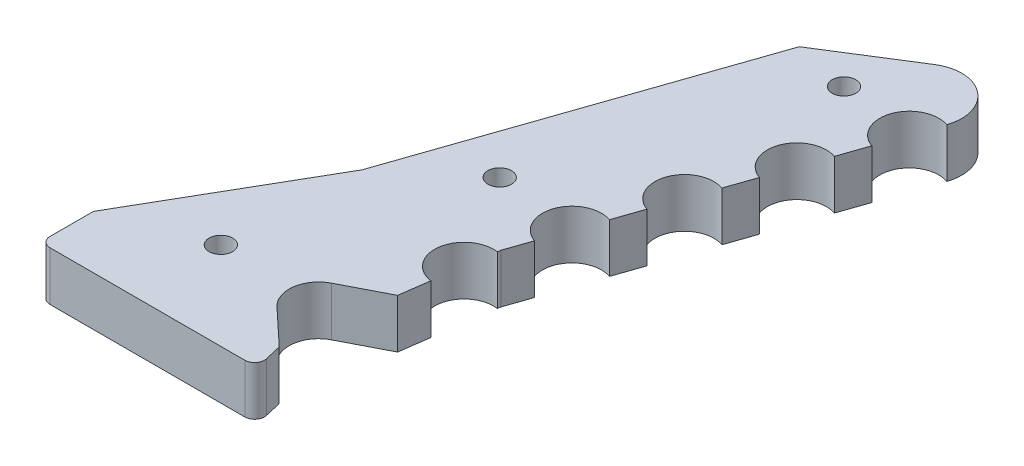
ISO-10303-21;
HEADER;
FILE_DESCRIPTION(('STEP AP214'),'2;1');
FILE_NAME('part.step','',(''),(''),'','','');
FILE_SCHEMA(('AUTOMOTIVE_DESIGN { 1 0 10303 214 1 1 1 1 }'));
ENDSEC;
DATA;
#1=APPLICATION_CONTEXT('core data for automotive mechanical design processes');
#2=APPLICATION_PROTOCOL_DEFINITION('international standard','automotive_design',2000,#1);
#3=PRODUCT_CONTEXT('',#1,'mechanical');
#4=PRODUCT('Part','Part','',(#3));
#5=PRODUCT_RELATED_PRODUCT_CATEGORY('part','',(#4));
#6=PRODUCT_DEFINITION_FORMATION('','',#4);
#7=PRODUCT_DEFINITION_CONTEXT('part definition',#1,'design');
#8=PRODUCT_DEFINITION('design','',#6,#7);
#9=PRODUCT_DEFINITION_SHAPE('','',#8);
#10=(LENGTH_UNIT() NAMED_UNIT(*) SI_UNIT(.MILLI.,.METRE.));
#11=(NAMED_UNIT(*) PLANE_ANGLE_UNIT() SI_UNIT($,.RADIAN.));
#12=(NAMED_UNIT(*) SI_UNIT($,.STERADIAN.) SOLID_ANGLE_UNIT());
#13=UNCERTAINTY_MEASURE_WITH_UNIT(LENGTH_MEASURE(1.E-05),#10,'distance_accuracy_value','');
#14=(GEOMETRIC_REPRESENTATION_CONTEXT(3) GLOBAL_UNCERTAINTY_ASSIGNED_CONTEXT((#13)) GLOBAL_UNIT_ASSIGNED_CONTEXT((#10,
#11,#12)) REPRESENTATION_CONTEXT('',''));
#15=CARTESIAN_POINT('',(0.,0.,0.));
#16=DIRECTION('',(0.,0.,1.));
#17=DIRECTION('',(1.,0.,0.));
#18=AXIS2_PLACEMENT_3D('',#15,#16,#17);
#19=CARTESIAN_POINT('',(24.1578897639016,5.,-47.3205080756888));
#20=DIRECTION('',(-0.990411286938688,0.,-0.138150217895061));
#21=DIRECTION('',(-0.138150217895061,0.,0.990411286938688));
#22=AXIS2_PLACEMENT_3D('',#19,#20,#21);
#23=PLANE('',#22);
#24=DIRECTION('',(0.138150217895061,0.,-0.990411286938688));
#25=VECTOR('',#24,1.);
#26=CARTESIAN_POINT('',(24.1578897639016,0.,-47.3205080756888));
#27=LINE('',#26,#25);
#28=CARTESIAN_POINT('',(22.8683748660811,0.,-38.0758602645134));
#29=VERTEX_POINT('',#28);
#30=CARTESIAN_POINT('',(23.2828255197663,0.,-41.0470941253295));
#31=VERTEX_POINT('',#30);
#32=EDGE_CURVE('E304',#29,#31,#27,.T.);
#33=ORIENTED_EDGE('',*,*,#32,.T.);
#34=DIRECTION('',(0.,1.,0.));
#35=VECTOR('',#34,1.);
#36=CARTESIAN_POINT('',(23.2828255197663,0.,-41.0470941253295));
#37=LINE('',#36,#35);
#38=CARTESIAN_POINT('',(23.2828255197663,5.,-41.0470941253295));
#39=VERTEX_POINT('',#38);
#40=EDGE_CURVE('E354',#31,#39,#37,.T.);
#41=ORIENTED_EDGE('',*,*,#40,.T.);
#42=DIRECTION('',(0.138150217895061,0.,-0.990411286938688));
#43=VECTOR('',#42,1.);
#44=CARTESIAN_POINT('',(24.1578897639016,5.,-47.3205080756888));
#45=LINE('',#44,#43);
#46=CARTESIAN_POINT('',(22.8683748660811,5.,-38.0758602645134));
#47=VERTEX_POINT('',#46);
#48=EDGE_CURVE('E283',#47,#39,#45,.T.);
#49=ORIENTED_EDGE('',*,*,#48,.F.);
#50=DIRECTION('',(0.,1.,0.));
#51=VECTOR('',#50,1.);
#52=CARTESIAN_POINT('',(22.8683748660811,0.,-38.0758602645134));
#53=LINE('',#52,#51);
#54=EDGE_CURVE('E364',#29,#47,#53,.T.);
#55=ORIENTED_EDGE('',*,*,#54,.F.);
#56=EDGE_LOOP('',(#33,#41,#49,#55));
#57=FACE_BOUND('',#56,.T.);
#58=ADVANCED_FACE('F36',(#57),#23,.F.);
#59=CARTESIAN_POINT('',(35.7715563017747,5.,-81.0490447646801));
#60=DIRECTION('',(-0.945518575599318,0.,-0.325568154457154));
#61=DIRECTION('',(-0.325568154457154,0.,0.945518575599318));
#62=AXIS2_PLACEMENT_3D('',#59,#60,#61);
#63=PLANE('',#62);
#64=DIRECTION('',(0.325568154457154,0.,-0.945518575599318));
#65=VECTOR('',#64,1.);
#66=CARTESIAN_POINT('',(35.7715563017747,0.,-81.0490447646801));
#67=LINE('',#66,#65);
#68=CARTESIAN_POINT('',(29.911329521546,0.,-64.0297104038924));
#69=VERTEX_POINT('',#68);
#70=CARTESIAN_POINT('',(30.8880339849174,0.,-66.8662661306903));
#71=VERTEX_POINT('',#70);
#72=EDGE_CURVE('E314',#69,#71,#67,.T.);
#73=ORIENTED_EDGE('',*,*,#72,.T.);
#74=DIRECTION('',(0.,1.,0.));
#75=VECTOR('',#74,1.);
#76=CARTESIAN_POINT('',(30.8880339849174,0.,-66.8662661306903));
#77=LINE('',#76,#75);
#78=CARTESIAN_POINT('',(30.8880339849174,5.,-66.8662661306903));
#79=VERTEX_POINT('',#78);
#80=EDGE_CURVE('E420',#71,#79,#77,.T.);
#81=ORIENTED_EDGE('',*,*,#80,.T.);
#82=DIRECTION('',(0.325568154457154,0.,-0.945518575599318));
#83=VECTOR('',#82,1.);
#84=CARTESIAN_POINT('',(35.7715563017747,5.,-81.0490447646801));
#85=LINE('',#84,#83);
#86=CARTESIAN_POINT('',(29.911329521546,5.,-64.0297104038924));
#87=VERTEX_POINT('',#86);
#88=EDGE_CURVE('E432',#87,#79,#85,.T.);
#89=ORIENTED_EDGE('',*,*,#88,.F.);
#90=DIRECTION('',(0.,1.,0.));
#91=VECTOR('',#90,1.);
#92=CARTESIAN_POINT('',(29.911329521546,0.,-64.0297104038924));
#93=LINE('',#92,#91);
#94=EDGE_CURVE('E339',#69,#87,#93,.T.);
#95=ORIENTED_EDGE('',*,*,#94,.F.);
#96=EDGE_LOOP('',(#73,#81,#89,#95));
#97=FACE_BOUND('',#96,.T.);
#98=ADVANCED_FACE('F460',(#97),#63,.F.);
#99=CARTESIAN_POINT('',(26.9812161314316,0.,-55.5200432234985));
#100=VERTEX_POINT('',#99);
#101=CARTESIAN_POINT('',(27.957920594803,0.,-58.3565989502965));
#102=VERTEX_POINT('',#101);
#103=EDGE_CURVE('E227',#100,#102,#67,.T.);
#104=ORIENTED_EDGE('',*,*,#103,.T.);
#105=DIRECTION('',(0.,1.,0.));
#106=VECTOR('',#105,1.);
#107=CARTESIAN_POINT('',(27.957920594803,0.,-58.3565989502965));
#108=LINE('',#107,#106);
#109=CARTESIAN_POINT('',(27.957920594803,5.,-58.3565989502965));
#110=VERTEX_POINT('',#109);
#111=EDGE_CURVE('E329',#102,#110,#108,.T.);
#112=ORIENTED_EDGE('',*,*,#111,.T.);
#113=CARTESIAN_POINT('',(26.9812161314316,5.,-55.5200432234985));
#114=VERTEX_POINT('',#113);
#115=EDGE_CURVE('E293',#114,#110,#85,.T.);
#116=ORIENTED_EDGE('',*,*,#115,.F.);
#117=DIRECTION('',(0.,1.,0.));
#118=VECTOR('',#117,1.);
#119=CARTESIAN_POINT('',(26.9812161314316,0.,-55.5200432234985));
#120=LINE('',#119,#118);
#121=EDGE_CURVE('E331',#100,#114,#120,.T.);
#122=ORIENTED_EDGE('',*,*,#121,.F.);
#123=EDGE_LOOP('',(#104,#112,#116,#122));
#124=FACE_BOUND('',#123,.T.);
#125=ADVANCED_FACE('F327',(#124),#63,.F.);
#126=CARTESIAN_POINT('',(24.1578897639016,0.,-47.3205080756888));
#127=VERTEX_POINT('',#126);
#128=CARTESIAN_POINT('',(25.0278072046886,0.,-49.8469317699026));
#129=VERTEX_POINT('',#128);
#130=EDGE_CURVE('E221',#127,#129,#67,.T.);
#131=ORIENTED_EDGE('',*,*,#130,.T.);
#132=DIRECTION('',(0.,1.,0.));
#133=VECTOR('',#132,1.);
#134=CARTESIAN_POINT('',(25.0278072046887,0.,-49.8469317699026));
#135=LINE('',#134,#133);
#136=CARTESIAN_POINT('',(25.0278072046887,5.,-49.8469317699026));
#137=VERTEX_POINT('',#136);
#138=EDGE_CURVE('E343',#129,#137,#135,.T.);
#139=ORIENTED_EDGE('',*,*,#138,.T.);
#140=CARTESIAN_POINT('',(24.1578897639016,5.,-47.3205080756888));
#141=VERTEX_POINT('',#140);
#142=EDGE_CURVE('E290',#141,#137,#85,.T.);
#143=ORIENTED_EDGE('',*,*,#142,.F.);
#144=DIRECTION('',(0.,-1.,0.));
#145=VECTOR('',#144,1.);
#146=CARTESIAN_POINT('',(24.1578897639016,5.,-47.3205080756888));
#147=LINE('',#146,#145);
#148=EDGE_CURVE('E212',#141,#127,#147,.T.);
#149=ORIENTED_EDGE('',*,*,#148,.T.);
#150=EDGE_LOOP('',(#131,#139,#143,#149));
#151=FACE_BOUND('',#150,.T.);
#152=ADVANCED_FACE('F443',(#151),#63,.F.);
#153=CARTESIAN_POINT('',(21.3948854060003,5.,-80.4136582216649));
#154=DIRECTION('',(0.532370499844366,0.,0.846511459399966));
#155=DIRECTION('',(0.846511459399966,0.,-0.532370499844366));
#156=AXIS2_PLACEMENT_3D('',#153,#154,#155);
#157=PLANE('',#156);
#158=DIRECTION('',(-0.846511459399966,0.,0.532370499844366));
#159=VECTOR('',#158,1.);
#160=CARTESIAN_POINT('',(21.3948854060003,0.,-80.4136582216649));
#161=LINE('',#160,#159);
#162=CARTESIAN_POINT('',(29.86,0.,-85.7373632201086));
#163=VERTEX_POINT('',#162);
#164=CARTESIAN_POINT('',(21.3948854060003,0.,-80.4136582216649));
#165=VERTEX_POINT('',#164);
#166=EDGE_CURVE('E219',#163,#165,#161,.T.);
#167=ORIENTED_EDGE('',*,*,#166,.T.);
#168=DIRECTION('',(0.,-1.,0.));
#169=VECTOR('',#168,1.);
#170=CARTESIAN_POINT('',(21.3948854060003,5.,-80.4136582216649));
#171=LINE('',#170,#169);
#172=CARTESIAN_POINT('',(21.3948854060003,5.,-80.4136582216649));
#173=VERTEX_POINT('',#172);
#174=EDGE_CURVE('E244',#173,#165,#171,.T.);
#175=ORIENTED_EDGE('',*,*,#174,.F.);
#176=DIRECTION('',(-0.846511459399966,0.,0.532370499844366));
#177=VECTOR('',#176,1.);
#178=CARTESIAN_POINT('',(21.3948854060003,5.,-80.4136582216649));
#179=LINE('',#178,#177);
#180=CARTESIAN_POINT('',(29.86,5.,-85.7373632201086));
#181=VERTEX_POINT('',#180);
#182=EDGE_CURVE('E220',#181,#173,#179,.T.);
#183=ORIENTED_EDGE('',*,*,#182,.F.);
#184=DIRECTION('',(0.,-1.,0.));
#185=VECTOR('',#184,1.);
#186=CARTESIAN_POINT('',(29.86,5.,-85.7373632201086));
#187=LINE('',#186,#185);
#188=EDGE_CURVE('E213',#181,#163,#187,.T.);
#189=ORIENTED_EDGE('',*,*,#188,.T.);
#190=EDGE_LOOP('',(#167,#175,#183,#189));
#191=FACE_BOUND('',#190,.T.);
#192=ADVANCED_FACE('F482',(#191),#157,.F.);
#193=CARTESIAN_POINT('',(9.99999999999996,5.,-47.3205080756888));
#194=DIRECTION('',(0.945518575599318,0.,0.325568154457154));
#195=DIRECTION('',(0.325568154457154,0.,-0.945518575599318));
#196=AXIS2_PLACEMENT_3D('',#193,#194,#195);
#197=PLANE('',#196);
#198=DIRECTION('',(-0.325568154457154,0.,0.945518575599318));
#199=VECTOR('',#198,1.);
#200=CARTESIAN_POINT('',(9.99999999999996,0.,-47.3205080756888));
#201=LINE('',#200,#199);
#202=CARTESIAN_POINT('',(9.99999999999996,0.,-47.3205080756888));
#203=VERTEX_POINT('',#202);
#204=EDGE_CURVE('E297',#165,#203,#201,.T.);
#205=ORIENTED_EDGE('',*,*,#204,.T.);
#206=DIRECTION('',(0.,-1.,0.));
#207=VECTOR('',#206,1.);
#208=CARTESIAN_POINT('',(9.99999999999996,5.,-47.3205080756888));
#209=LINE('',#208,#207);
#210=CARTESIAN_POINT('',(9.99999999999996,5.,-47.3205080756888));
#211=VERTEX_POINT('',#210);
#212=EDGE_CURVE('E241',#211,#203,#209,.T.);
#213=ORIENTED_EDGE('',*,*,#212,.F.);
#214=DIRECTION('',(-0.325568154457154,0.,0.945518575599318));
#215=VECTOR('',#214,1.);
#216=CARTESIAN_POINT('',(9.99999999999996,5.,-47.3205080756888));
#217=LINE('',#216,#215);
#218=EDGE_CURVE('E224',#173,#211,#217,.T.);
#219=ORIENTED_EDGE('',*,*,#218,.F.);
#220=ORIENTED_EDGE('',*,*,#174,.T.);
#221=EDGE_LOOP('',(#205,#213,#219,#220));
#222=FACE_BOUND('',#221,.T.);
#223=ADVANCED_FACE('F479',(#222),#197,.F.);
#224=CARTESIAN_POINT('',(0.,5.,-30.));
#225=DIRECTION('',(0.86602540378444,0.,0.499999999999998));
#226=DIRECTION('',(0.499999999999998,0.,-0.86602540378444));
#227=AXIS2_PLACEMENT_3D('',#224,#225,#226);
#228=PLANE('',#227);
#229=DIRECTION('',(-0.499999999999998,0.,0.86602540378444));
#230=VECTOR('',#229,1.);
#231=CARTESIAN_POINT('',(0.,0.,-30.));
#232=LINE('',#231,#230);
#233=CARTESIAN_POINT('',(0.,0.,-30.));
#234=VERTEX_POINT('',#233);
#235=EDGE_CURVE('E299',#203,#234,#232,.T.);
#236=ORIENTED_EDGE('',*,*,#235,.T.);
#237=DIRECTION('',(0.,-1.,0.));
#238=VECTOR('',#237,1.);
#239=CARTESIAN_POINT('',(0.,5.,-30.));
#240=LINE('',#239,#238);
#241=CARTESIAN_POINT('',(0.,5.,-30.));
#242=VERTEX_POINT('',#241);
#243=EDGE_CURVE('E238',#242,#234,#240,.T.);
#244=ORIENTED_EDGE('',*,*,#243,.F.);
#245=DIRECTION('',(-0.499999999999998,0.,0.86602540378444));
#246=VECTOR('',#245,1.);
#247=CARTESIAN_POINT('',(0.,5.,-30.));
#248=LINE('',#247,#246);
#249=EDGE_CURVE('E286',#211,#242,#248,.T.);
#250=ORIENTED_EDGE('',*,*,#249,.F.);
#251=ORIENTED_EDGE('',*,*,#212,.T.);
#252=EDGE_LOOP('',(#236,#244,#250,#251));
#253=FACE_BOUND('',#252,.T.);
#254=ADVANCED_FACE('F395',(#253),#228,.F.);
#255=CARTESIAN_POINT('',(0.,5.,0.));
#256=DIRECTION('',(1.,0.,0.));
#257=DIRECTION('',(0.,0.,-1.));
#258=AXIS2_PLACEMENT_3D('',#255,#256,#257);
#259=PLANE('',#258);
#260=DIRECTION('',(0.,0.,1.));
#261=VECTOR('',#260,1.);
#262=CARTESIAN_POINT('',(0.,0.,0.));
#263=LINE('',#262,#261);
#264=CARTESIAN_POINT('',(0.,0.,-25.5883219764711));
#265=VERTEX_POINT('',#264);
#266=EDGE_CURVE('E301',#234,#265,#263,.T.);
#267=ORIENTED_EDGE('',*,*,#266,.T.);
#268=DIRECTION('',(0.,1.,0.));
#269=VECTOR('',#268,1.);
#270=CARTESIAN_POINT('',(0.,5.,-25.5883219764711));
#271=LINE('',#270,#269);
#272=CARTESIAN_POINT('',(0.,5.,-25.5883219764711));
#273=VERTEX_POINT('',#272);
#274=EDGE_CURVE('E11',#265,#273,#271,.T.);
#275=ORIENTED_EDGE('',*,*,#274,.T.);
#276=DIRECTION('',(0.,0.,1.));
#277=VECTOR('',#276,1.);
#278=CARTESIAN_POINT('',(0.,5.,0.));
#279=LINE('',#278,#277);
#280=EDGE_CURVE('E281',#242,#273,#279,.T.);
#281=ORIENTED_EDGE('',*,*,#280,.F.);
#282=ORIENTED_EDGE('',*,*,#243,.T.);
#283=EDGE_LOOP('',(#267,#275,#281,#282));
#284=FACE_BOUND('',#283,.T.);
#285=ADVANCED_FACE('F398',(#284),#259,.F.);
#286=CARTESIAN_POINT('',(21.3948854060003,5.,-27.512282336915));
#287=DIRECTION('',(-0.974653453481312,0.,0.223720016129428));
#288=DIRECTION('',(0.223720016129428,0.,0.974653453481312));
#289=AXIS2_PLACEMENT_3D('',#286,#287,#288);
#290=PLANE('',#289);
#291=DIRECTION('',(-0.223720016129428,0.,-0.974653453481312));
#292=VECTOR('',#291,1.);
#293=CARTESIAN_POINT('',(21.3948854060003,5.,-27.512282336915));
#294=LINE('',#293,#292);
#295=CARTESIAN_POINT('',(21.785155194606,5.,-25.8120419926005));
#296=VERTEX_POINT('',#295);
#297=CARTESIAN_POINT('',(21.3948854060003,5.,-27.512282336915));
#298=VERTEX_POINT('',#297);
#299=EDGE_CURVE('E276',#296,#298,#294,.T.);
#300=ORIENTED_EDGE('',*,*,#299,.F.);
#301=DIRECTION('',(0.,1.,0.));
#302=VECTOR('',#301,1.);
#303=CARTESIAN_POINT('',(21.785155194606,5.,-25.8120419926005));
#304=LINE('',#303,#302);
#305=CARTESIAN_POINT('',(21.785155194606,0.,-25.8120419926005));
#306=VERTEX_POINT('',#305);
#307=EDGE_CURVE('E59',#296,#306,#304,.F.);
#308=ORIENTED_EDGE('',*,*,#307,.T.);
#309=DIRECTION('',(-0.223720016129428,0.,-0.974653453481312));
#310=VECTOR('',#309,1.);
#311=CARTESIAN_POINT('',(21.3948854060003,0.,-27.512282336915));
#312=LINE('',#311,#310);
#313=CARTESIAN_POINT('',(21.3948854060003,0.,-27.512282336915));
#314=VERTEX_POINT('',#313);
#315=EDGE_CURVE('E261',#306,#314,#312,.T.);
#316=ORIENTED_EDGE('',*,*,#315,.T.);
#317=DIRECTION('',(0.,-1.,0.));
#318=VECTOR('',#317,1.);
#319=CARTESIAN_POINT('',(21.3948854060003,5.,-27.512282336915));
#320=LINE('',#319,#318);
#321=EDGE_CURVE('E235',#298,#314,#320,.T.);
#322=ORIENTED_EDGE('',*,*,#321,.F.);
#323=EDGE_LOOP('',(#300,#308,#316,#322));
#324=FACE_BOUND('',#323,.T.);
#325=ADVANCED_FACE('F279',(#324),#290,.F.);
#326=CARTESIAN_POINT('',(24.1117268271366,5.,-46.9895618469616));
#327=VERTEX_POINT('',#326);
#328=EDGE_CURVE('E280',#327,#141,#45,.T.);
#329=ORIENTED_EDGE('',*,*,#328,.F.);
#330=DIRECTION('',(0.,1.,0.));
#331=VECTOR('',#330,1.);
#332=CARTESIAN_POINT('',(24.1117268271366,0.,-46.9895618469616));
#333=LINE('',#332,#331);
#334=CARTESIAN_POINT('',(24.1117268271366,0.,-46.9895618469616));
#335=VERTEX_POINT('',#334);
#336=EDGE_CURVE('E361',#335,#327,#333,.T.);
#337=ORIENTED_EDGE('',*,*,#336,.F.);
#338=EDGE_CURVE('E303',#335,#127,#27,.T.);
#339=ORIENTED_EDGE('',*,*,#338,.T.);
#340=ORIENTED_EDGE('',*,*,#148,.F.);
#341=EDGE_LOOP('',(#329,#337,#339,#340));
#342=FACE_BOUND('',#341,.T.);
#343=ADVANCED_FACE('F445',(#342),#23,.F.);
#344=CARTESIAN_POINT('',(32.8414429116603,0.,-72.5393775842862));
#345=VERTEX_POINT('',#344);
#346=CARTESIAN_POINT('',(33.8181473750318,0.,-75.3759333110842));
#347=VERTEX_POINT('',#346);
#348=EDGE_CURVE('E229',#345,#347,#67,.T.);
#349=ORIENTED_EDGE('',*,*,#348,.T.);
#350=DIRECTION('',(0.,1.,0.));
#351=VECTOR('',#350,1.);
#352=CARTESIAN_POINT('',(33.8181473750318,0.,-75.3759333110842));
#353=LINE('',#352,#351);
#354=CARTESIAN_POINT('',(33.8181473750318,5.,-75.3759333110842));
#355=VERTEX_POINT('',#354);
#356=EDGE_CURVE('E199',#347,#355,#353,.T.);
#357=ORIENTED_EDGE('',*,*,#356,.T.);
#358=CARTESIAN_POINT('',(32.8414429116603,5.,-72.5393775842862));
#359=VERTEX_POINT('',#358);
#360=EDGE_CURVE('E294',#359,#355,#85,.T.);
#361=ORIENTED_EDGE('',*,*,#360,.F.);
#362=DIRECTION('',(0.,1.,0.));
#363=VECTOR('',#362,1.);
#364=CARTESIAN_POINT('',(32.8414429116603,0.,-72.5393775842862));
#365=LINE('',#364,#363);
#366=EDGE_CURVE('E346',#345,#359,#365,.T.);
#367=ORIENTED_EDGE('',*,*,#366,.F.);
#368=EDGE_LOOP('',(#349,#357,#361,#367));
#369=FACE_BOUND('',#368,.T.);
#370=ADVANCED_FACE('F433',(#369),#63,.F.);
#371=CARTESIAN_POINT('',(31.9894819993774,5.,-82.3513173825088));
#372=DIRECTION('',(0.,-1.,0.));
#373=DIRECTION('',(0.,0.,-1.));
#374=AXIS2_PLACEMENT_3D('',#371,#372,#373);
#375=CYLINDRICAL_SURFACE('',#374,3.99999999999999);
#376=CARTESIAN_POINT('',(31.9894819993774,0.,-82.3513173825088));
#377=DIRECTION('',(0.,1.,0.));
#378=DIRECTION('',(0.,0.,-1.));
#379=AXIS2_PLACEMENT_3D('',#376,#377,#378);
#380=CIRCLE('',#379,3.99999999999999);
#381=CARTESIAN_POINT('',(35.7715563017747,0.,-81.0490447646801));
#382=VERTEX_POINT('',#381);
#383=EDGE_CURVE('E209',#382,#163,#380,.T.);
#384=ORIENTED_EDGE('',*,*,#383,.T.);
#385=ORIENTED_EDGE('',*,*,#188,.F.);
#386=CARTESIAN_POINT('',(31.9894819993774,5.,-82.3513173825088));
#387=DIRECTION('',(0.,1.,0.));
#388=DIRECTION('',(0.,0.,-1.));
#389=AXIS2_PLACEMENT_3D('',#386,#387,#388);
#390=CIRCLE('',#389,3.99999999999999);
#391=CARTESIAN_POINT('',(35.7715563017747,5.,-81.0490447646801));
#392=VERTEX_POINT('',#391);
#393=EDGE_CURVE('E211',#392,#181,#390,.T.);
#394=ORIENTED_EDGE('',*,*,#393,.F.);
#395=DIRECTION('',(0.,-1.,0.));
#396=VECTOR('',#395,1.);
#397=CARTESIAN_POINT('',(35.7715563017747,5.,-81.0490447646801));
#398=LINE('',#397,#396);
#399=EDGE_CURVE('E196',#392,#382,#398,.T.);
#400=ORIENTED_EDGE('',*,*,#399,.T.);
#401=EDGE_LOOP('',(#384,#385,#394,#400));
#402=FACE_BOUND('',#401,.T.);
#403=ADVANCED_FACE('F207',(#402),#375,.T.);
#404=CARTESIAN_POINT('',(31.9894819993774,5.,-82.3513173825088));
#405=DIRECTION('',(0.,-1.,0.));
#406=DIRECTION('',(0.,0.,-1.));
#407=AXIS2_PLACEMENT_3D('',#404,#405,#406);
#408=PLANE('',#407);
#409=CARTESIAN_POINT('',(9.43278631160015,5.,-33.5342728019948));
#410=DIRECTION('',(0.,1.,0.));
#411=DIRECTION('',(0.,0.,1.));
#412=AXIS2_PLACEMENT_3D('',#409,#410,#411);
#413=CIRCLE('',#412,1.2);
#414=CARTESIAN_POINT('',(9.43278631160015,5.,-32.3342728019948));
#415=VERTEX_POINT('',#414);
#416=EDGE_CURVE('E382',#415,#415,#413,.T.);
#417=ORIENTED_EDGE('',*,*,#416,.F.);
#418=EDGE_LOOP('',(#417));
#419=FACE_BOUND('',#418,.T.);
#420=CARTESIAN_POINT('',(17.6754420810914,5.,-53.660191960072));
#421=DIRECTION('',(0.,1.,0.));
#422=DIRECTION('',(0.,0.,1.));
#423=AXIS2_PLACEMENT_3D('',#420,#421,#422);
#424=CIRCLE('',#423,1.2);
#425=CARTESIAN_POINT('',(17.6754420810914,5.,-52.460191960072));
#426=VERTEX_POINT('',#425);
#427=EDGE_CURVE('E408',#426,#426,#424,.T.);
#428=ORIENTED_EDGE('',*,*,#427,.F.);
#429=EDGE_LOOP('',(#428));
#430=FACE_BOUND('',#429,.T.);
#431=CARTESIAN_POINT('',(27.1732683912637,5.,-79.1891935012536));
#432=DIRECTION('',(0.,1.,0.));
#433=DIRECTION('',(0.,0.,1.));
#434=AXIS2_PLACEMENT_3D('',#431,#432,#433);
#435=CIRCLE('',#434,1.2);
#436=CARTESIAN_POINT('',(27.1732683912637,5.,-77.9891935012536));
#437=VERTEX_POINT('',#436);
#438=EDGE_CURVE('E414',#437,#437,#435,.T.);
#439=ORIENTED_EDGE('',*,*,#438,.F.);
#440=EDGE_LOOP('',(#439));
#441=FACE_BOUND('',#440,.T.);
#442=DIRECTION('',(-1.,0.,0.));
#443=VECTOR('',#442,1.);
#444=CARTESIAN_POINT('',(22.0660454543886,5.,-24.5883219764711));
#445=LINE('',#444,#443);
#446=CARTESIAN_POINT('',(20.8105017411247,5.,-24.5883219764711));
#447=VERTEX_POINT('',#446);
#448=CARTESIAN_POINT('',(1.,5.,-24.5883219764711));
#449=VERTEX_POINT('',#448);
#450=EDGE_CURVE('E270',#447,#449,#445,.T.);
#451=ORIENTED_EDGE('',*,*,#450,.F.);
#452=CARTESIAN_POINT('',(20.8105017411247,5.,-25.5883219764711));
#453=DIRECTION('',(0.,-1.,0.));
#454=DIRECTION('',(0.,0.,-1.));
#455=AXIS2_PLACEMENT_3D('',#452,#453,#454);
#456=CIRCLE('',#455,1.);
#457=EDGE_CURVE('E254',#447,#296,#456,.F.);
#458=ORIENTED_EDGE('',*,*,#457,.T.);
#459=ORIENTED_EDGE('',*,*,#299,.T.);
#460=DIRECTION('',(-0.72987002388853,0.,-0.6835859479458));
#461=VECTOR('',#460,1.);
#462=CARTESIAN_POINT('',(23.7242831618267,5.,-25.3306013239371));
#463=LINE('',#462,#461);
#464=CARTESIAN_POINT('',(17.7455352865577,5.,-30.930212076644));
#465=VERTEX_POINT('',#464);
#466=EDGE_CURVE('E371',#298,#465,#463,.T.);
#467=ORIENTED_EDGE('',*,*,#466,.T.);
#468=CARTESIAN_POINT('',(19.7962931303951,5.,-33.1198221483096));
#469=DIRECTION('',(0.,1.,0.));
#470=DIRECTION('',(0.,0.,1.));
#471=AXIS2_PLACEMENT_3D('',#468,#469,#470);
#472=CIRCLE('',#471,3.);
#473=CARTESIAN_POINT('',(18.4230038326927,5.,-35.7870447683427));
#474=VERTEX_POINT('',#473);
#475=EDGE_CURVE('E381',#474,#465,#472,.T.);
#476=ORIENTED_EDGE('',*,*,#475,.F.);
#477=DIRECTION('',(-0.889074206677684,0.,0.457763099234143));
#478=VECTOR('',#477,1.);
#479=CARTESIAN_POINT('',(-10.7043172544185,5.,-20.7900820029413));
#480=LINE('',#479,#478);
#481=EDGE_CURVE('E378',#47,#474,#480,.T.);
#482=ORIENTED_EDGE('',*,*,#481,.F.);
#483=ORIENTED_EDGE('',*,*,#48,.T.);
#484=CARTESIAN_POINT('',(23.6972761734514,5.,-44.0183279861455));
#485=DIRECTION('',(0.,1.,0.));
#486=DIRECTION('',(0.,0.,1.));
#487=AXIS2_PLACEMENT_3D('',#484,#485,#486);
#488=CIRCLE('',#487,3.);
#489=EDGE_CURVE('E362',#327,#39,#488,.T.);
#490=ORIENTED_EDGE('',*,*,#489,.F.);
#491=ORIENTED_EDGE('',*,*,#328,.T.);
#492=ORIENTED_EDGE('',*,*,#142,.T.);
#493=CARTESIAN_POINT('',(26.0045116680601,5.,-52.6834874967006));
#494=DIRECTION('',(0.,1.,0.));
#495=DIRECTION('',(0.,0.,1.));
#496=AXIS2_PLACEMENT_3D('',#493,#494,#495);
#497=CIRCLE('',#496,3.);
#498=EDGE_CURVE('E352',#114,#137,#497,.T.);
#499=ORIENTED_EDGE('',*,*,#498,.F.);
#500=ORIENTED_EDGE('',*,*,#115,.T.);
#501=CARTESIAN_POINT('',(28.9346250581745,5.,-61.1931546770944));
#502=DIRECTION('',(0.,1.,0.));
#503=DIRECTION('',(0.,0.,1.));
#504=AXIS2_PLACEMENT_3D('',#501,#502,#503);
#505=CIRCLE('',#504,3.);
#506=EDGE_CURVE('E340',#87,#110,#505,.T.);
#507=ORIENTED_EDGE('',*,*,#506,.F.);
#508=ORIENTED_EDGE('',*,*,#88,.T.);
#509=CARTESIAN_POINT('',(31.8647384482889,5.,-69.7028218574883));
#510=DIRECTION('',(0.,1.,0.));
#511=DIRECTION('',(0.,0.,1.));
#512=AXIS2_PLACEMENT_3D('',#509,#510,#511);
#513=CIRCLE('',#512,3.00000000000001);
#514=EDGE_CURVE('E349',#359,#79,#513,.T.);
#515=ORIENTED_EDGE('',*,*,#514,.F.);
#516=ORIENTED_EDGE('',*,*,#360,.T.);
#517=CARTESIAN_POINT('',(34.7948518384033,5.,-78.2124890378822));
#518=DIRECTION('',(0.,1.,0.));
#519=DIRECTION('',(0.,0.,1.));
#520=AXIS2_PLACEMENT_3D('',#517,#518,#519);
#521=CIRCLE('',#520,3.00000000000001);
#522=EDGE_CURVE('E203',#392,#355,#521,.T.);
#523=ORIENTED_EDGE('',*,*,#522,.F.);
#524=ORIENTED_EDGE('',*,*,#393,.T.);
#525=ORIENTED_EDGE('',*,*,#182,.T.);
#526=ORIENTED_EDGE('',*,*,#218,.T.);
#527=ORIENTED_EDGE('',*,*,#249,.T.);
#528=ORIENTED_EDGE('',*,*,#280,.T.);
#529=CARTESIAN_POINT('',(1.,5.,-25.5883219764711));
#530=DIRECTION('',(0.,-1.,0.));
#531=DIRECTION('',(0.,0.,-1.));
#532=AXIS2_PLACEMENT_3D('',#529,#530,#531);
#533=CIRCLE('',#532,1.);
#534=EDGE_CURVE('E252',#273,#449,#533,.F.);
#535=ORIENTED_EDGE('',*,*,#534,.T.);
#536=EDGE_LOOP('',(#451,#458,#459,#467,#476,#482,#483,#490,#491,#492,#499,#500,#507,#508,#515,
#516,#523,#524,#525,#526,#527,#528,#535));
#537=FACE_BOUND('',#536,.T.);
#538=ADVANCED_FACE('F274',(#419,#430,#441,#537),#408,.F.);
#539=CARTESIAN_POINT('',(31.9894819993774,0.,-82.3513173825088));
#540=DIRECTION('',(0.,-1.,0.));
#541=DIRECTION('',(0.,0.,-1.));
#542=AXIS2_PLACEMENT_3D('',#539,#540,#541);
#543=PLANE('',#542);
#544=ORIENTED_EDGE('',*,*,#315,.F.);
#545=CARTESIAN_POINT('',(20.8105017411247,0.,-25.5883219764711));
#546=DIRECTION('',(0.,-1.,0.));
#547=DIRECTION('',(0.,0.,-1.));
#548=AXIS2_PLACEMENT_3D('',#545,#546,#547);
#549=CIRCLE('',#548,1.);
#550=CARTESIAN_POINT('',(20.8105017411247,0.,-24.5883219764711));
#551=VERTEX_POINT('',#550);
#552=EDGE_CURVE('E44',#306,#551,#549,.T.);
#553=ORIENTED_EDGE('',*,*,#552,.T.);
#554=DIRECTION('',(-1.,0.,0.));
#555=VECTOR('',#554,1.);
#556=CARTESIAN_POINT('',(28.6147132621544,0.,-24.5883219764711));
#557=LINE('',#556,#555);
#558=CARTESIAN_POINT('',(1.,0.,-24.5883219764711));
#559=VERTEX_POINT('',#558);
#560=EDGE_CURVE('E259',#551,#559,#557,.T.);
#561=ORIENTED_EDGE('',*,*,#560,.T.);
#562=CARTESIAN_POINT('',(1.,0.,-25.5883219764711));
#563=DIRECTION('',(0.,-1.,0.));
#564=DIRECTION('',(0.,0.,-1.));
#565=AXIS2_PLACEMENT_3D('',#562,#563,#564);
#566=CIRCLE('',#565,1.);
#567=EDGE_CURVE('E51',#559,#265,#566,.T.);
#568=ORIENTED_EDGE('',*,*,#567,.T.);
#569=ORIENTED_EDGE('',*,*,#266,.F.);
#570=ORIENTED_EDGE('',*,*,#235,.F.);
#571=ORIENTED_EDGE('',*,*,#204,.F.);
#572=ORIENTED_EDGE('',*,*,#166,.F.);
#573=ORIENTED_EDGE('',*,*,#383,.F.);
#574=CARTESIAN_POINT('',(34.7948518384033,0.,-78.2124890378822));
#575=DIRECTION('',(0.,1.,0.));
#576=DIRECTION('',(0.,0.,1.));
#577=AXIS2_PLACEMENT_3D('',#574,#575,#576);
#578=CIRCLE('',#577,3.00000000000001);
#579=EDGE_CURVE('E193',#382,#347,#578,.T.);
#580=ORIENTED_EDGE('',*,*,#579,.T.);
#581=ORIENTED_EDGE('',*,*,#348,.F.);
#582=CARTESIAN_POINT('',(31.8647384482889,0.,-69.7028218574883));
#583=DIRECTION('',(0.,1.,0.));
#584=DIRECTION('',(0.,0.,1.));
#585=AXIS2_PLACEMENT_3D('',#582,#583,#584);
#586=CIRCLE('',#585,3.00000000000001);
#587=EDGE_CURVE('E422',#345,#71,#586,.T.);
#588=ORIENTED_EDGE('',*,*,#587,.T.);
#589=ORIENTED_EDGE('',*,*,#72,.F.);
#590=CARTESIAN_POINT('',(28.9346250581745,0.,-61.1931546770944));
#591=DIRECTION('',(0.,1.,0.));
#592=DIRECTION('',(0.,0.,1.));
#593=AXIS2_PLACEMENT_3D('',#590,#591,#592);
#594=CIRCLE('',#593,3.);
#595=EDGE_CURVE('E336',#69,#102,#594,.T.);
#596=ORIENTED_EDGE('',*,*,#595,.T.);
#597=ORIENTED_EDGE('',*,*,#103,.F.);
#598=CARTESIAN_POINT('',(26.0045116680601,0.,-52.6834874967006));
#599=DIRECTION('',(0.,1.,0.));
#600=DIRECTION('',(0.,0.,1.));
#601=AXIS2_PLACEMENT_3D('',#598,#599,#600);
#602=CIRCLE('',#601,3.);
#603=EDGE_CURVE('E335',#100,#129,#602,.T.);
#604=ORIENTED_EDGE('',*,*,#603,.T.);
#605=ORIENTED_EDGE('',*,*,#130,.F.);
#606=ORIENTED_EDGE('',*,*,#338,.F.);
#607=CARTESIAN_POINT('',(23.6972761734514,0.,-44.0183279861455));
#608=DIRECTION('',(0.,1.,0.));
#609=DIRECTION('',(0.,0.,1.));
#610=AXIS2_PLACEMENT_3D('',#607,#608,#609);
#611=CIRCLE('',#610,3.);
#612=EDGE_CURVE('E358',#335,#31,#611,.T.);
#613=ORIENTED_EDGE('',*,*,#612,.T.);
#614=ORIENTED_EDGE('',*,*,#32,.F.);
#615=DIRECTION('',(-0.889074206677684,0.,0.457763099234143));
#616=VECTOR('',#615,1.);
#617=CARTESIAN_POINT('',(-10.7043172544185,0.,-20.7900820029413));
#618=LINE('',#617,#616);
#619=CARTESIAN_POINT('',(18.4230038326927,0.,-35.7870447683427));
#620=VERTEX_POINT('',#619);
#621=EDGE_CURVE('E367',#29,#620,#618,.T.);
#622=ORIENTED_EDGE('',*,*,#621,.T.);
#623=CARTESIAN_POINT('',(19.7962931303951,0.,-33.1198221483096));
#624=DIRECTION('',(0.,1.,0.));
#625=DIRECTION('',(0.,0.,1.));
#626=AXIS2_PLACEMENT_3D('',#623,#624,#625);
#627=CIRCLE('',#626,3.);
#628=CARTESIAN_POINT('',(17.7455352865577,0.,-30.9302120766441));
#629=VERTEX_POINT('',#628);
#630=EDGE_CURVE('E370',#620,#629,#627,.T.);
#631=ORIENTED_EDGE('',*,*,#630,.T.);
#632=DIRECTION('',(-0.72987002388853,0.,-0.6835859479458));
#633=VECTOR('',#632,1.);
#634=CARTESIAN_POINT('',(23.7242831618267,0.,-25.3306013239371));
#635=LINE('',#634,#633);
#636=EDGE_CURVE('E374',#314,#629,#635,.T.);
#637=ORIENTED_EDGE('',*,*,#636,.F.);
#638=EDGE_LOOP('',(#544,#553,#561,#568,#569,#570,#571,#572,#573,#580,#581,#588,#589,#596,#597,
#604,#605,#606,#613,#614,#622,#631,#637));
#639=FACE_BOUND('',#638,.T.);
#640=CARTESIAN_POINT('',(9.43278631160015,0.,-33.5342728019948));
#641=DIRECTION('',(0.,1.,0.));
#642=DIRECTION('',(0.,0.,1.));
#643=AXIS2_PLACEMENT_3D('',#640,#641,#642);
#644=CIRCLE('',#643,1.2);
#645=CARTESIAN_POINT('',(9.43278631160015,0.,-32.3342728019948));
#646=VERTEX_POINT('',#645);
#647=EDGE_CURVE('E405',#646,#646,#644,.T.);
#648=ORIENTED_EDGE('',*,*,#647,.T.);
#649=EDGE_LOOP('',(#648));
#650=FACE_BOUND('',#649,.T.);
#651=CARTESIAN_POINT('',(17.6754420810914,0.,-53.660191960072));
#652=DIRECTION('',(0.,1.,0.));
#653=DIRECTION('',(0.,0.,1.));
#654=AXIS2_PLACEMENT_3D('',#651,#652,#653);
#655=CIRCLE('',#654,1.2);
#656=CARTESIAN_POINT('',(17.6754420810914,0.,-52.460191960072));
#657=VERTEX_POINT('',#656);
#658=EDGE_CURVE('E411',#657,#657,#655,.T.);
#659=ORIENTED_EDGE('',*,*,#658,.T.);
#660=EDGE_LOOP('',(#659));
#661=FACE_BOUND('',#660,.T.);
#662=CARTESIAN_POINT('',(27.1732683912637,0.,-79.1891935012536));
#663=DIRECTION('',(0.,1.,0.));
#664=DIRECTION('',(0.,0.,1.));
#665=AXIS2_PLACEMENT_3D('',#662,#663,#664);
#666=CIRCLE('',#665,1.2);
#667=CARTESIAN_POINT('',(27.1732683912637,0.,-77.9891935012536));
#668=VERTEX_POINT('',#667);
#669=EDGE_CURVE('E269',#668,#668,#666,.T.);
#670=ORIENTED_EDGE('',*,*,#669,.T.);
#671=EDGE_LOOP('',(#670));
#672=FACE_BOUND('',#671,.T.);
#673=ADVANCED_FACE('F216',(#639,#650,#661,#672),#543,.T.);
#674=CARTESIAN_POINT('',(-10.7043172544185,0.,-20.7900820029413));
#675=DIRECTION('',(-0.457763099234143,0.,-0.889074206677684));
#676=DIRECTION('',(-0.889074206677684,0.,0.457763099234143));
#677=AXIS2_PLACEMENT_3D('',#674,#675,#676);
#678=PLANE('',#677);
#679=ORIENTED_EDGE('',*,*,#481,.T.);
#680=DIRECTION('',(0.,1.,0.));
#681=VECTOR('',#680,1.);
#682=CARTESIAN_POINT('',(18.4230038326927,0.,-35.7870447683427));
#683=LINE('',#682,#681);
#684=EDGE_CURVE('E377',#620,#474,#683,.T.);
#685=ORIENTED_EDGE('',*,*,#684,.F.);
#686=ORIENTED_EDGE('',*,*,#621,.F.);
#687=ORIENTED_EDGE('',*,*,#54,.T.);
#688=EDGE_LOOP('',(#679,#685,#686,#687));
#689=FACE_BOUND('',#688,.T.);
#690=ADVANCED_FACE('F562',(#689),#678,.F.);
#691=CARTESIAN_POINT('',(23.7242831618267,0.,-25.3306013239371));
#692=DIRECTION('',(0.6835859479458,0.,-0.72987002388853));
#693=DIRECTION('',(-0.72987002388853,0.,-0.6835859479458));
#694=AXIS2_PLACEMENT_3D('',#691,#692,#693);
#695=PLANE('',#694);
#696=ORIENTED_EDGE('',*,*,#466,.F.);
#697=ORIENTED_EDGE('',*,*,#321,.T.);
#698=ORIENTED_EDGE('',*,*,#636,.T.);
#699=DIRECTION('',(0.,1.,0.));
#700=VECTOR('',#699,1.);
#701=CARTESIAN_POINT('',(17.7455352865577,0.,-30.930212076644));
#702=LINE('',#701,#700);
#703=EDGE_CURVE('E387',#629,#465,#702,.T.);
#704=ORIENTED_EDGE('',*,*,#703,.T.);
#705=EDGE_LOOP('',(#696,#697,#698,#704));
#706=FACE_BOUND('',#705,.T.);
#707=ADVANCED_FACE('F588',(#706),#695,.T.);
#708=CARTESIAN_POINT('',(19.7962931303951,0.,-33.1198221483096));
#709=DIRECTION('',(0.,1.,0.));
#710=DIRECTION('',(0.,0.,1.));
#711=AXIS2_PLACEMENT_3D('',#708,#709,#710);
#712=CYLINDRICAL_SURFACE('',#711,3.);
#713=ORIENTED_EDGE('',*,*,#475,.T.);
#714=ORIENTED_EDGE('',*,*,#703,.F.);
#715=ORIENTED_EDGE('',*,*,#630,.F.);
#716=ORIENTED_EDGE('',*,*,#684,.T.);
#717=EDGE_LOOP('',(#713,#714,#715,#716));
#718=FACE_BOUND('',#717,.T.);
#719=ADVANCED_FACE('F457',(#718),#712,.F.);
#720=CARTESIAN_POINT('',(23.6972761734514,0.,-44.0183279861455));
#721=DIRECTION('',(0.,1.,0.));
#722=DIRECTION('',(0.,0.,1.));
#723=AXIS2_PLACEMENT_3D('',#720,#721,#722);
#724=CYLINDRICAL_SURFACE('',#723,3.);
#725=ORIENTED_EDGE('',*,*,#489,.T.);
#726=ORIENTED_EDGE('',*,*,#40,.F.);
#727=ORIENTED_EDGE('',*,*,#612,.F.);
#728=ORIENTED_EDGE('',*,*,#336,.T.);
#729=EDGE_LOOP('',(#725,#726,#727,#728));
#730=FACE_BOUND('',#729,.T.);
#731=ADVANCED_FACE('F441',(#730),#724,.F.);
#732=CARTESIAN_POINT('',(26.0045116680601,0.,-52.6834874967006));
#733=DIRECTION('',(0.,1.,0.));
#734=DIRECTION('',(0.,0.,1.));
#735=AXIS2_PLACEMENT_3D('',#732,#733,#734);
#736=CYLINDRICAL_SURFACE('',#735,3.);
#737=ORIENTED_EDGE('',*,*,#498,.T.);
#738=ORIENTED_EDGE('',*,*,#138,.F.);
#739=ORIENTED_EDGE('',*,*,#603,.F.);
#740=ORIENTED_EDGE('',*,*,#121,.T.);
#741=EDGE_LOOP('',(#737,#738,#739,#740));
#742=FACE_BOUND('',#741,.T.);
#743=ADVANCED_FACE('F448',(#742),#736,.F.);
#744=CARTESIAN_POINT('',(28.9346250581745,0.,-61.1931546770944));
#745=DIRECTION('',(0.,1.,0.));
#746=DIRECTION('',(0.,0.,1.));
#747=AXIS2_PLACEMENT_3D('',#744,#745,#746);
#748=CYLINDRICAL_SURFACE('',#747,3.);
#749=ORIENTED_EDGE('',*,*,#506,.T.);
#750=ORIENTED_EDGE('',*,*,#111,.F.);
#751=ORIENTED_EDGE('',*,*,#595,.F.);
#752=ORIENTED_EDGE('',*,*,#94,.T.);
#753=EDGE_LOOP('',(#749,#750,#751,#752));
#754=FACE_BOUND('',#753,.T.);
#755=ADVANCED_FACE('F450',(#754),#748,.F.);
#756=CARTESIAN_POINT('',(31.8647384482889,0.,-69.7028218574883));
#757=DIRECTION('',(0.,1.,0.));
#758=DIRECTION('',(0.,0.,1.));
#759=AXIS2_PLACEMENT_3D('',#756,#757,#758);
#760=CYLINDRICAL_SURFACE('',#759,3.00000000000001);
#761=ORIENTED_EDGE('',*,*,#514,.T.);
#762=ORIENTED_EDGE('',*,*,#80,.F.);
#763=ORIENTED_EDGE('',*,*,#587,.F.);
#764=ORIENTED_EDGE('',*,*,#366,.T.);
#765=EDGE_LOOP('',(#761,#762,#763,#764));
#766=FACE_BOUND('',#765,.T.);
#767=ADVANCED_FACE('F428',(#766),#760,.F.);
#768=CARTESIAN_POINT('',(34.7948518384033,0.,-78.2124890378822));
#769=DIRECTION('',(0.,1.,0.));
#770=DIRECTION('',(0.,0.,1.));
#771=AXIS2_PLACEMENT_3D('',#768,#769,#770);
#772=CYLINDRICAL_SURFACE('',#771,3.00000000000001);
#773=ORIENTED_EDGE('',*,*,#522,.T.);
#774=ORIENTED_EDGE('',*,*,#356,.F.);
#775=ORIENTED_EDGE('',*,*,#579,.F.);
#776=ORIENTED_EDGE('',*,*,#399,.F.);
#777=EDGE_LOOP('',(#773,#774,#775,#776));
#778=FACE_BOUND('',#777,.T.);
#779=ADVANCED_FACE('F195',(#778),#772,.F.);
#780=CARTESIAN_POINT('',(27.1732683912637,0.,-79.1891935012536));
#781=DIRECTION('',(0.,1.,0.));
#782=DIRECTION('',(0.,0.,1.));
#783=AXIS2_PLACEMENT_3D('',#780,#781,#782);
#784=CYLINDRICAL_SURFACE('',#783,1.2);
#785=ORIENTED_EDGE('',*,*,#669,.F.);
#786=EDGE_LOOP('',(#785));
#787=FACE_BOUND('',#786,.T.);
#788=ORIENTED_EDGE('',*,*,#438,.T.);
#789=EDGE_LOOP('',(#788));
#790=FACE_BOUND('',#789,.T.);
#791=ADVANCED_FACE('F502',(#787,#790),#784,.F.);
#792=CARTESIAN_POINT('',(17.6754420810914,0.,-53.660191960072));
#793=DIRECTION('',(0.,1.,0.));
#794=DIRECTION('',(0.,0.,1.));
#795=AXIS2_PLACEMENT_3D('',#792,#793,#794);
#796=CYLINDRICAL_SURFACE('',#795,1.2);
#797=ORIENTED_EDGE('',*,*,#658,.F.);
#798=EDGE_LOOP('',(#797));
#799=FACE_BOUND('',#798,.T.);
#800=ORIENTED_EDGE('',*,*,#427,.T.);
#801=EDGE_LOOP('',(#800));
#802=FACE_BOUND('',#801,.T.);
#803=ADVANCED_FACE('F496',(#799,#802),#796,.F.);
#804=CARTESIAN_POINT('',(9.43278631160015,0.,-33.5342728019948));
#805=DIRECTION('',(0.,1.,0.));
#806=DIRECTION('',(0.,0.,1.));
#807=AXIS2_PLACEMENT_3D('',#804,#805,#806);
#808=CYLINDRICAL_SURFACE('',#807,1.2);
#809=ORIENTED_EDGE('',*,*,#647,.F.);
#810=EDGE_LOOP('',(#809));
#811=FACE_BOUND('',#810,.T.);
#812=ORIENTED_EDGE('',*,*,#416,.T.);
#813=EDGE_LOOP('',(#812));
#814=FACE_BOUND('',#813,.T.);
#815=ADVANCED_FACE('F491',(#811,#814),#808,.F.);
#816=CARTESIAN_POINT('',(22.0660454543886,0.,-24.5883219764711));
#817=DIRECTION('',(0.,0.,-1.));
#818=DIRECTION('',(-1.,0.,0.));
#819=AXIS2_PLACEMENT_3D('',#816,#817,#818);
#820=PLANE('',#819);
#821=ORIENTED_EDGE('',*,*,#560,.F.);
#822=DIRECTION('',(0.,1.,0.));
#823=VECTOR('',#822,1.);
#824=CARTESIAN_POINT('',(20.8105017411247,0.,-24.5883219764711));
#825=LINE('',#824,#823);
#826=EDGE_CURVE('E249',#551,#447,#825,.T.);
#827=ORIENTED_EDGE('',*,*,#826,.T.);
#828=ORIENTED_EDGE('',*,*,#450,.T.);
#829=DIRECTION('',(0.,1.,0.));
#830=VECTOR('',#829,1.);
#831=CARTESIAN_POINT('',(1.,0.,-24.5883219764711));
#832=LINE('',#831,#830);
#833=EDGE_CURVE('E247',#449,#559,#832,.F.);
#834=ORIENTED_EDGE('',*,*,#833,.T.);
#835=EDGE_LOOP('',(#821,#827,#828,#834));
#836=FACE_BOUND('',#835,.T.);
#837=ADVANCED_FACE('F265',(#836),#820,.F.);
#838=CARTESIAN_POINT('',(20.8105017411247,0.,-25.5883219764711));
#839=DIRECTION('',(0.,1.,0.));
#840=DIRECTION('',(0.,0.,1.));
#841=AXIS2_PLACEMENT_3D('',#838,#839,#840);
#842=CYLINDRICAL_SURFACE('',#841,1.);
#843=ORIENTED_EDGE('',*,*,#552,.F.);
#844=ORIENTED_EDGE('',*,*,#307,.F.);
#845=ORIENTED_EDGE('',*,*,#457,.F.);
#846=ORIENTED_EDGE('',*,*,#826,.F.);
#847=EDGE_LOOP('',(#843,#844,#845,#846));
#848=FACE_BOUND('',#847,.T.);
#849=ADVANCED_FACE('F272',(#848),#842,.T.);
#850=CARTESIAN_POINT('',(1.,5.,-25.5883219764711));
#851=DIRECTION('',(0.,1.,0.));
#852=DIRECTION('',(0.,0.,1.));
#853=AXIS2_PLACEMENT_3D('',#850,#851,#852);
#854=CYLINDRICAL_SURFACE('',#853,1.);
#855=ORIENTED_EDGE('',*,*,#567,.F.);
#856=ORIENTED_EDGE('',*,*,#833,.F.);
#857=ORIENTED_EDGE('',*,*,#534,.F.);
#858=ORIENTED_EDGE('',*,*,#274,.F.);
#859=EDGE_LOOP('',(#855,#856,#857,#858));
#860=FACE_BOUND('',#859,.T.);
#861=ADVANCED_FACE('F38',(#860),#854,.T.);
#862=CLOSED_SHELL('',(#58,#98,#125,#152,#192,#223,#254,#285,#325,#343,#370,#403,#538,#673,#690,
#707,#719,#731,#743,#755,#767,#779,#791,#803,#815,#837,#849,#861));
#863=MANIFOLD_SOLID_BREP('B2',#862);
#864=ADVANCED_BREP_SHAPE_REPRESENTATION('',(#18,#863),#14);
#865=SHAPE_DEFINITION_REPRESENTATION(#9,#864);
ENDSEC;
END-ISO-10303-21;
